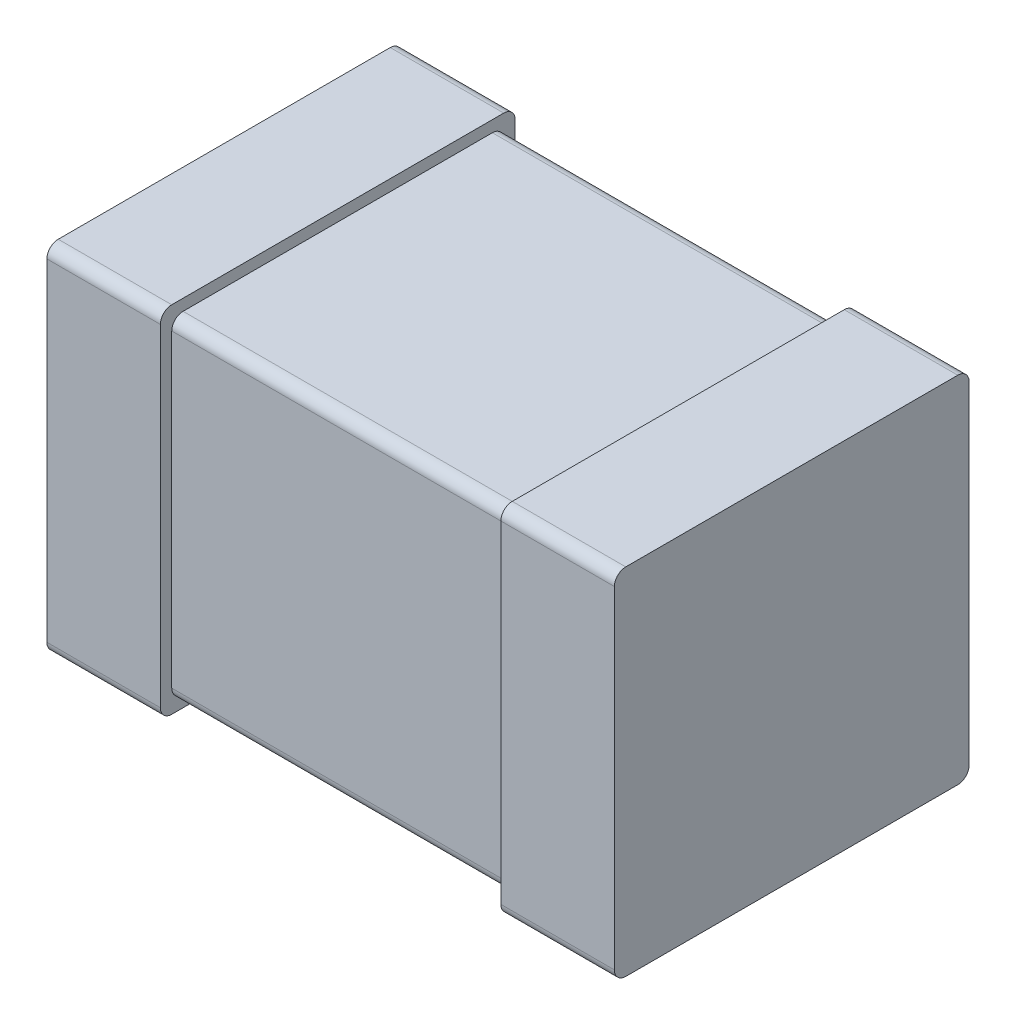
ISO-10303-21;
HEADER;
FILE_DESCRIPTION(('STEP AP214'),'2;1');
FILE_NAME('part.step','',(''),(''),'','','');
FILE_SCHEMA(('AUTOMOTIVE_DESIGN { 1 0 10303 214 1 1 1 1 }'));
ENDSEC;
DATA;
#1=APPLICATION_CONTEXT('core data for automotive mechanical design processes');
#2=APPLICATION_PROTOCOL_DEFINITION('international standard','automotive_design',2000,#1);
#3=PRODUCT_CONTEXT('',#1,'mechanical');
#4=PRODUCT('Part','Part','',(#3));
#5=PRODUCT_RELATED_PRODUCT_CATEGORY('part','',(#4));
#6=PRODUCT_DEFINITION_FORMATION('','',#4);
#7=PRODUCT_DEFINITION_CONTEXT('part definition',#1,'design');
#8=PRODUCT_DEFINITION('design','',#6,#7);
#9=PRODUCT_DEFINITION_SHAPE('','',#8);
#10=(LENGTH_UNIT() NAMED_UNIT(*) SI_UNIT(.MILLI.,.METRE.));
#11=(NAMED_UNIT(*) PLANE_ANGLE_UNIT() SI_UNIT($,.RADIAN.));
#12=(NAMED_UNIT(*) SI_UNIT($,.STERADIAN.) SOLID_ANGLE_UNIT());
#13=UNCERTAINTY_MEASURE_WITH_UNIT(LENGTH_MEASURE(1.E-05),#10,'distance_accuracy_value','');
#14=(GEOMETRIC_REPRESENTATION_CONTEXT(3) GLOBAL_UNCERTAINTY_ASSIGNED_CONTEXT((#13)) GLOBAL_UNIT_ASSIGNED_CONTEXT((#10,
#11,#12)) REPRESENTATION_CONTEXT('',''));
#15=CARTESIAN_POINT('',(0.,0.,0.));
#16=DIRECTION('',(0.,0.,1.));
#17=DIRECTION('',(1.,0.,0.));
#18=AXIS2_PLACEMENT_3D('',#15,#16,#17);
#19=CARTESIAN_POINT('',(-1.,-0.625,0.));
#20=DIRECTION('',(1.,0.,0.));
#21=DIRECTION('',(0.,1.,0.));
#22=AXIS2_PLACEMENT_3D('',#19,#20,#21);
#23=PLANE('',#22);
#24=CARTESIAN_POINT('',(-1.,-0.585,1.21));
#25=DIRECTION('',(-1.,0.,0.));
#26=DIRECTION('',(0.,0.,1.));
#27=AXIS2_PLACEMENT_3D('',#24,#25,#26);
#28=CIRCLE('',#27,0.04);
#29=CARTESIAN_POINT('',(-1.,-0.625,1.21));
#30=VERTEX_POINT('',#29);
#31=CARTESIAN_POINT('',(-1.,-0.585,1.25));
#32=VERTEX_POINT('',#31);
#33=EDGE_CURVE('E11',#30,#32,#28,.T.);
#34=ORIENTED_EDGE('',*,*,#33,.T.);
#35=DIRECTION('',(0.,1.,0.));
#36=VECTOR('',#35,1.);
#37=CARTESIAN_POINT('',(-1.,-0.625,1.25));
#38=LINE('',#37,#36);
#39=CARTESIAN_POINT('',(-1.,0.585,1.25));
#40=VERTEX_POINT('',#39);
#41=EDGE_CURVE('E27',#32,#40,#38,.T.);
#42=ORIENTED_EDGE('',*,*,#41,.T.);
#43=CARTESIAN_POINT('',(-1.,0.585,1.21));
#44=DIRECTION('',(1.,0.,0.));
#45=DIRECTION('',(0.,0.,1.));
#46=AXIS2_PLACEMENT_3D('',#43,#44,#45);
#47=CIRCLE('',#46,0.04);
#48=CARTESIAN_POINT('',(-1.,0.625,1.21));
#49=VERTEX_POINT('',#48);
#50=EDGE_CURVE('E342',#49,#40,#47,.T.);
#51=ORIENTED_EDGE('',*,*,#50,.F.);
#52=DIRECTION('',(0.,0.,1.));
#53=VECTOR('',#52,1.);
#54=CARTESIAN_POINT('',(-1.,0.625,0.));
#55=LINE('',#54,#53);
#56=CARTESIAN_POINT('',(-1.,0.625,0.04));
#57=VERTEX_POINT('',#56);
#58=EDGE_CURVE('E288',#57,#49,#55,.T.);
#59=ORIENTED_EDGE('',*,*,#58,.F.);
#60=CARTESIAN_POINT('',(-1.,0.585,0.04));
#61=DIRECTION('',(-1.,0.,0.));
#62=DIRECTION('',(0.,0.,1.));
#63=AXIS2_PLACEMENT_3D('',#60,#61,#62);
#64=CIRCLE('',#63,0.04);
#65=CARTESIAN_POINT('',(-1.,0.585,0.));
#66=VERTEX_POINT('',#65);
#67=EDGE_CURVE('E501',#57,#66,#64,.T.);
#68=ORIENTED_EDGE('',*,*,#67,.T.);
#69=DIRECTION('',(0.,1.,0.));
#70=VECTOR('',#69,1.);
#71=CARTESIAN_POINT('',(-1.,-0.625,0.));
#72=LINE('',#71,#70);
#73=CARTESIAN_POINT('',(-1.,-0.585,0.));
#74=VERTEX_POINT('',#73);
#75=EDGE_CURVE('E364',#74,#66,#72,.T.);
#76=ORIENTED_EDGE('',*,*,#75,.F.);
#77=CARTESIAN_POINT('',(-1.,-0.585,0.04));
#78=DIRECTION('',(1.,0.,0.));
#79=DIRECTION('',(0.,0.,1.));
#80=AXIS2_PLACEMENT_3D('',#77,#78,#79);
#81=CIRCLE('',#80,0.04);
#82=CARTESIAN_POINT('',(-1.,-0.625,0.04));
#83=VERTEX_POINT('',#82);
#84=EDGE_CURVE('E312',#83,#74,#81,.T.);
#85=ORIENTED_EDGE('',*,*,#84,.F.);
#86=DIRECTION('',(0.,0.,1.));
#87=VECTOR('',#86,1.);
#88=CARTESIAN_POINT('',(-1.,-0.625,0.));
#89=LINE('',#88,#87);
#90=EDGE_CURVE('E410',#83,#30,#89,.T.);
#91=ORIENTED_EDGE('',*,*,#90,.T.);
#92=EDGE_LOOP('',(#34,#42,#51,#59,#68,#76,#85,#91));
#93=FACE_BOUND('',#92,.T.);
#94=ADVANCED_FACE('F16',(#93),#23,.F.);
#95=CARTESIAN_POINT('',(-1.,-0.625,0.));
#96=DIRECTION('',(0.,1.,0.));
#97=DIRECTION('',(1.,0.,0.));
#98=AXIS2_PLACEMENT_3D('',#95,#96,#97);
#99=PLANE('',#98);
#100=DIRECTION('',(1.,0.,0.));
#101=VECTOR('',#100,1.);
#102=CARTESIAN_POINT('',(-1.,-0.625,1.21));
#103=LINE('',#102,#101);
#104=CARTESIAN_POINT('',(-0.6,-0.625,1.21));
#105=VERTEX_POINT('',#104);
#106=EDGE_CURVE('E313',#30,#105,#103,.T.);
#107=ORIENTED_EDGE('',*,*,#106,.F.);
#108=ORIENTED_EDGE('',*,*,#90,.F.);
#109=DIRECTION('',(1.,0.,0.));
#110=VECTOR('',#109,1.);
#111=CARTESIAN_POINT('',(-1.,-0.625,0.04));
#112=LINE('',#111,#110);
#113=CARTESIAN_POINT('',(-0.6,-0.625,0.04));
#114=VERTEX_POINT('',#113);
#115=EDGE_CURVE('E406',#83,#114,#112,.T.);
#116=ORIENTED_EDGE('',*,*,#115,.T.);
#117=DIRECTION('',(0.,0.,1.));
#118=VECTOR('',#117,1.);
#119=CARTESIAN_POINT('',(-0.6,-0.625,0.));
#120=LINE('',#119,#118);
#121=EDGE_CURVE('E411',#114,#105,#120,.T.);
#122=ORIENTED_EDGE('',*,*,#121,.T.);
#123=EDGE_LOOP('',(#107,#108,#116,#122));
#124=FACE_BOUND('',#123,.T.);
#125=ADVANCED_FACE('F566',(#124),#99,.F.);
#126=CARTESIAN_POINT('',(-1.,-0.585,0.04));
#127=DIRECTION('',(1.,0.,0.));
#128=DIRECTION('',(0.,-1.,0.));
#129=AXIS2_PLACEMENT_3D('',#126,#127,#128);
#130=CYLINDRICAL_SURFACE('',#129,0.04);
#131=ORIENTED_EDGE('',*,*,#84,.T.);
#132=DIRECTION('',(1.,0.,0.));
#133=VECTOR('',#132,1.);
#134=CARTESIAN_POINT('',(-1.,-0.585,0.));
#135=LINE('',#134,#133);
#136=CARTESIAN_POINT('',(-0.6,-0.585,0.));
#137=VERTEX_POINT('',#136);
#138=EDGE_CURVE('E308',#74,#137,#135,.T.);
#139=ORIENTED_EDGE('',*,*,#138,.T.);
#140=CARTESIAN_POINT('',(-0.6,-0.585,0.04));
#141=DIRECTION('',(1.,0.,0.));
#142=DIRECTION('',(0.,0.,1.));
#143=AXIS2_PLACEMENT_3D('',#140,#141,#142);
#144=CIRCLE('',#143,0.04);
#145=EDGE_CURVE('E470',#114,#137,#144,.T.);
#146=ORIENTED_EDGE('',*,*,#145,.F.);
#147=ORIENTED_EDGE('',*,*,#115,.F.);
#148=EDGE_LOOP('',(#131,#139,#146,#147));
#149=FACE_BOUND('',#148,.T.);
#150=ADVANCED_FACE('F549',(#149),#130,.T.);
#151=CARTESIAN_POINT('',(-1.,-0.585,1.21));
#152=DIRECTION('',(1.,0.,0.));
#153=DIRECTION('',(0.,-1.,0.));
#154=AXIS2_PLACEMENT_3D('',#151,#152,#153);
#155=CYLINDRICAL_SURFACE('',#154,0.04);
#156=ORIENTED_EDGE('',*,*,#106,.T.);
#157=CARTESIAN_POINT('',(-0.6,-0.585,1.21));
#158=DIRECTION('',(-1.,0.,0.));
#159=DIRECTION('',(0.,0.,1.));
#160=AXIS2_PLACEMENT_3D('',#157,#158,#159);
#161=CIRCLE('',#160,0.04);
#162=CARTESIAN_POINT('',(-0.6,-0.585,1.25));
#163=VERTEX_POINT('',#162);
#164=EDGE_CURVE('E363',#105,#163,#161,.T.);
#165=ORIENTED_EDGE('',*,*,#164,.T.);
#166=DIRECTION('',(1.,0.,0.));
#167=VECTOR('',#166,1.);
#168=CARTESIAN_POINT('',(-1.,-0.585,1.25));
#169=LINE('',#168,#167);
#170=EDGE_CURVE('E387',#32,#163,#169,.T.);
#171=ORIENTED_EDGE('',*,*,#170,.F.);
#172=ORIENTED_EDGE('',*,*,#33,.F.);
#173=EDGE_LOOP('',(#156,#165,#171,#172));
#174=FACE_BOUND('',#173,.T.);
#175=ADVANCED_FACE('F553',(#174),#155,.T.);
#176=CARTESIAN_POINT('',(-1.,-0.625,0.));
#177=DIRECTION('',(0.,0.,1.));
#178=DIRECTION('',(1.,0.,0.));
#179=AXIS2_PLACEMENT_3D('',#176,#177,#178);
#180=PLANE('',#179);
#181=DIRECTION('',(1.,0.,0.));
#182=VECTOR('',#181,1.);
#183=CARTESIAN_POINT('',(-1.,0.585,0.));
#184=LINE('',#183,#182);
#185=CARTESIAN_POINT('',(-0.6,0.585,0.));
#186=VERTEX_POINT('',#185);
#187=EDGE_CURVE('E360',#66,#186,#184,.T.);
#188=ORIENTED_EDGE('',*,*,#187,.T.);
#189=DIRECTION('',(0.,1.,0.));
#190=VECTOR('',#189,1.);
#191=CARTESIAN_POINT('',(-0.6,-0.625,0.));
#192=LINE('',#191,#190);
#193=EDGE_CURVE('E372',#137,#186,#192,.T.);
#194=ORIENTED_EDGE('',*,*,#193,.F.);
#195=ORIENTED_EDGE('',*,*,#138,.F.);
#196=ORIENTED_EDGE('',*,*,#75,.T.);
#197=EDGE_LOOP('',(#188,#194,#195,#196));
#198=FACE_BOUND('',#197,.T.);
#199=ADVANCED_FACE('F551',(#198),#180,.F.);
#200=CARTESIAN_POINT('',(-1.,-0.625,1.25));
#201=DIRECTION('',(0.,0.,1.));
#202=DIRECTION('',(1.,0.,0.));
#203=AXIS2_PLACEMENT_3D('',#200,#201,#202);
#204=PLANE('',#203);
#205=ORIENTED_EDGE('',*,*,#41,.F.);
#206=ORIENTED_EDGE('',*,*,#170,.T.);
#207=DIRECTION('',(0.,1.,0.));
#208=VECTOR('',#207,1.);
#209=CARTESIAN_POINT('',(-0.6,-0.625,1.25));
#210=LINE('',#209,#208);
#211=CARTESIAN_POINT('',(-0.6,0.585,1.25));
#212=VERTEX_POINT('',#211);
#213=EDGE_CURVE('E346',#163,#212,#210,.T.);
#214=ORIENTED_EDGE('',*,*,#213,.T.);
#215=DIRECTION('',(1.,0.,0.));
#216=VECTOR('',#215,1.);
#217=CARTESIAN_POINT('',(-1.,0.585,1.25));
#218=LINE('',#217,#216);
#219=EDGE_CURVE('E424',#40,#212,#218,.T.);
#220=ORIENTED_EDGE('',*,*,#219,.F.);
#221=EDGE_LOOP('',(#205,#206,#214,#220));
#222=FACE_BOUND('',#221,.T.);
#223=ADVANCED_FACE('F526',(#222),#204,.T.);
#224=CARTESIAN_POINT('',(-1.,0.585,0.04));
#225=DIRECTION('',(1.,0.,0.));
#226=DIRECTION('',(0.,1.,0.));
#227=AXIS2_PLACEMENT_3D('',#224,#225,#226);
#228=CYLINDRICAL_SURFACE('',#227,0.04);
#229=DIRECTION('',(1.,0.,0.));
#230=VECTOR('',#229,1.);
#231=CARTESIAN_POINT('',(-1.,0.625,0.04));
#232=LINE('',#231,#230);
#233=CARTESIAN_POINT('',(-0.6,0.625,0.04));
#234=VERTEX_POINT('',#233);
#235=EDGE_CURVE('E341',#57,#234,#232,.T.);
#236=ORIENTED_EDGE('',*,*,#235,.T.);
#237=CARTESIAN_POINT('',(-0.6,0.585,0.04));
#238=DIRECTION('',(-1.,0.,0.));
#239=DIRECTION('',(0.,0.,1.));
#240=AXIS2_PLACEMENT_3D('',#237,#238,#239);
#241=CIRCLE('',#240,0.04);
#242=EDGE_CURVE('E337',#234,#186,#241,.T.);
#243=ORIENTED_EDGE('',*,*,#242,.T.);
#244=ORIENTED_EDGE('',*,*,#187,.F.);
#245=ORIENTED_EDGE('',*,*,#67,.F.);
#246=EDGE_LOOP('',(#236,#243,#244,#245));
#247=FACE_BOUND('',#246,.T.);
#248=ADVANCED_FACE('F539',(#247),#228,.T.);
#249=CARTESIAN_POINT('',(-1.,0.585,1.21));
#250=DIRECTION('',(1.,0.,0.));
#251=DIRECTION('',(0.,1.,0.));
#252=AXIS2_PLACEMENT_3D('',#249,#250,#251);
#253=CYLINDRICAL_SURFACE('',#252,0.04);
#254=ORIENTED_EDGE('',*,*,#50,.T.);
#255=ORIENTED_EDGE('',*,*,#219,.T.);
#256=CARTESIAN_POINT('',(-0.6,0.585,1.21));
#257=DIRECTION('',(1.,0.,0.));
#258=DIRECTION('',(0.,0.,1.));
#259=AXIS2_PLACEMENT_3D('',#256,#257,#258);
#260=CIRCLE('',#259,0.04);
#261=CARTESIAN_POINT('',(-0.6,0.625,1.21));
#262=VERTEX_POINT('',#261);
#263=EDGE_CURVE('E319',#262,#212,#260,.T.);
#264=ORIENTED_EDGE('',*,*,#263,.F.);
#265=DIRECTION('',(1.,0.,0.));
#266=VECTOR('',#265,1.);
#267=CARTESIAN_POINT('',(-1.,0.625,1.21));
#268=LINE('',#267,#266);
#269=EDGE_CURVE('E473',#49,#262,#268,.T.);
#270=ORIENTED_EDGE('',*,*,#269,.F.);
#271=EDGE_LOOP('',(#254,#255,#264,#270));
#272=FACE_BOUND('',#271,.T.);
#273=ADVANCED_FACE('F529',(#272),#253,.T.);
#274=CARTESIAN_POINT('',(-1.,0.625,0.));
#275=DIRECTION('',(0.,1.,0.));
#276=DIRECTION('',(1.,0.,0.));
#277=AXIS2_PLACEMENT_3D('',#274,#275,#276);
#278=PLANE('',#277);
#279=DIRECTION('',(0.,0.,1.));
#280=VECTOR('',#279,1.);
#281=CARTESIAN_POINT('',(-0.6,0.625,0.));
#282=LINE('',#281,#280);
#283=EDGE_CURVE('E323',#234,#262,#282,.T.);
#284=ORIENTED_EDGE('',*,*,#283,.F.);
#285=ORIENTED_EDGE('',*,*,#235,.F.);
#286=ORIENTED_EDGE('',*,*,#58,.T.);
#287=ORIENTED_EDGE('',*,*,#269,.T.);
#288=EDGE_LOOP('',(#284,#285,#286,#287));
#289=FACE_BOUND('',#288,.T.);
#290=ADVANCED_FACE('F532',(#289),#278,.T.);
#291=CARTESIAN_POINT('',(-0.6,-0.625,0.));
#292=DIRECTION('',(1.,0.,0.));
#293=DIRECTION('',(0.,1.,0.));
#294=AXIS2_PLACEMENT_3D('',#291,#292,#293);
#295=PLANE('',#294);
#296=ORIENTED_EDGE('',*,*,#121,.F.);
#297=ORIENTED_EDGE('',*,*,#145,.T.);
#298=ORIENTED_EDGE('',*,*,#193,.T.);
#299=ORIENTED_EDGE('',*,*,#242,.F.);
#300=ORIENTED_EDGE('',*,*,#283,.T.);
#301=ORIENTED_EDGE('',*,*,#263,.T.);
#302=ORIENTED_EDGE('',*,*,#213,.F.);
#303=ORIENTED_EDGE('',*,*,#164,.F.);
#304=EDGE_LOOP('',(#296,#297,#298,#299,#300,#301,#302,#303));
#305=FACE_BOUND('',#304,.T.);
#306=CARTESIAN_POINT('',(-0.6,-0.545,0.08));
#307=DIRECTION('',(1.,0.,0.));
#308=DIRECTION('',(0.,0.,1.));
#309=AXIS2_PLACEMENT_3D('',#306,#307,#308);
#310=CIRCLE('',#309,0.04);
#311=CARTESIAN_POINT('',(-0.6,-0.585,0.08));
#312=VERTEX_POINT('',#311);
#313=CARTESIAN_POINT('',(-0.6,-0.545,0.04));
#314=VERTEX_POINT('',#313);
#315=EDGE_CURVE('E272',#312,#314,#310,.T.);
#316=ORIENTED_EDGE('',*,*,#315,.F.);
#317=DIRECTION('',(0.,0.,1.));
#318=VECTOR('',#317,1.);
#319=CARTESIAN_POINT('',(-0.6,-0.585,0.04));
#320=LINE('',#319,#318);
#321=CARTESIAN_POINT('',(-0.6,-0.585,1.17));
#322=VERTEX_POINT('',#321);
#323=EDGE_CURVE('E324',#312,#322,#320,.T.);
#324=ORIENTED_EDGE('',*,*,#323,.T.);
#325=CARTESIAN_POINT('',(-0.6,-0.545,1.17));
#326=DIRECTION('',(-1.,0.,0.));
#327=DIRECTION('',(0.,0.,1.));
#328=AXIS2_PLACEMENT_3D('',#325,#326,#327);
#329=CIRCLE('',#328,0.04);
#330=CARTESIAN_POINT('',(-0.6,-0.545,1.21));
#331=VERTEX_POINT('',#330);
#332=EDGE_CURVE('E457',#322,#331,#329,.T.);
#333=ORIENTED_EDGE('',*,*,#332,.T.);
#334=DIRECTION('',(0.,1.,0.));
#335=VECTOR('',#334,1.);
#336=CARTESIAN_POINT('',(-0.6,-0.585,1.21));
#337=LINE('',#336,#335);
#338=CARTESIAN_POINT('',(-0.6,0.545,1.21));
#339=VERTEX_POINT('',#338);
#340=EDGE_CURVE('E271',#331,#339,#337,.T.);
#341=ORIENTED_EDGE('',*,*,#340,.T.);
#342=CARTESIAN_POINT('',(-0.6,0.545,1.17));
#343=DIRECTION('',(1.,0.,0.));
#344=DIRECTION('',(0.,0.,1.));
#345=AXIS2_PLACEMENT_3D('',#342,#343,#344);
#346=CIRCLE('',#345,0.04);
#347=CARTESIAN_POINT('',(-0.6,0.585,1.17));
#348=VERTEX_POINT('',#347);
#349=EDGE_CURVE('E253',#348,#339,#346,.T.);
#350=ORIENTED_EDGE('',*,*,#349,.F.);
#351=DIRECTION('',(0.,0.,1.));
#352=VECTOR('',#351,1.);
#353=CARTESIAN_POINT('',(-0.6,0.585,0.04));
#354=LINE('',#353,#352);
#355=CARTESIAN_POINT('',(-0.6,0.585,0.08));
#356=VERTEX_POINT('',#355);
#357=EDGE_CURVE('E247',#356,#348,#354,.T.);
#358=ORIENTED_EDGE('',*,*,#357,.F.);
#359=CARTESIAN_POINT('',(-0.6,0.545,0.08));
#360=DIRECTION('',(-1.,0.,0.));
#361=DIRECTION('',(0.,0.,1.));
#362=AXIS2_PLACEMENT_3D('',#359,#360,#361);
#363=CIRCLE('',#362,0.04);
#364=CARTESIAN_POINT('',(-0.6,0.545,0.04));
#365=VERTEX_POINT('',#364);
#366=EDGE_CURVE('E250',#356,#365,#363,.T.);
#367=ORIENTED_EDGE('',*,*,#366,.T.);
#368=DIRECTION('',(0.,1.,0.));
#369=VECTOR('',#368,1.);
#370=CARTESIAN_POINT('',(-0.6,-0.585,0.04));
#371=LINE('',#370,#369);
#372=EDGE_CURVE('E277',#314,#365,#371,.T.);
#373=ORIENTED_EDGE('',*,*,#372,.F.);
#374=EDGE_LOOP('',(#316,#324,#333,#341,#350,#358,#367,#373));
#375=FACE_BOUND('',#374,.T.);
#376=ADVANCED_FACE('F249',(#305,#375),#295,.T.);
#377=CARTESIAN_POINT('',(-0.6,-0.545,0.08));
#378=DIRECTION('',(1.,0.,0.));
#379=DIRECTION('',(0.,-1.,0.));
#380=AXIS2_PLACEMENT_3D('',#377,#378,#379);
#381=CYLINDRICAL_SURFACE('',#380,0.04);
#382=ORIENTED_EDGE('',*,*,#315,.T.);
#383=DIRECTION('',(1.,0.,0.));
#384=VECTOR('',#383,1.);
#385=CARTESIAN_POINT('',(-0.6,-0.545,0.04));
#386=LINE('',#385,#384);
#387=CARTESIAN_POINT('',(0.6,-0.545,0.04));
#388=VERTEX_POINT('',#387);
#389=EDGE_CURVE('E292',#314,#388,#386,.T.);
#390=ORIENTED_EDGE('',*,*,#389,.T.);
#391=CARTESIAN_POINT('',(0.6,-0.545,0.08));
#392=DIRECTION('',(1.,0.,0.));
#393=DIRECTION('',(0.,0.,1.));
#394=AXIS2_PLACEMENT_3D('',#391,#392,#393);
#395=CIRCLE('',#394,0.04);
#396=CARTESIAN_POINT('',(0.6,-0.585,0.08));
#397=VERTEX_POINT('',#396);
#398=EDGE_CURVE('E469',#397,#388,#395,.T.);
#399=ORIENTED_EDGE('',*,*,#398,.F.);
#400=DIRECTION('',(1.,0.,0.));
#401=VECTOR('',#400,1.);
#402=CARTESIAN_POINT('',(-0.6,-0.585,0.08));
#403=LINE('',#402,#401);
#404=EDGE_CURVE('E427',#312,#397,#403,.T.);
#405=ORIENTED_EDGE('',*,*,#404,.F.);
#406=EDGE_LOOP('',(#382,#390,#399,#405));
#407=FACE_BOUND('',#406,.T.);
#408=ADVANCED_FACE('F581',(#407),#381,.T.);
#409=CARTESIAN_POINT('',(-0.6,-0.585,0.04));
#410=DIRECTION('',(0.,0.,1.));
#411=DIRECTION('',(1.,0.,0.));
#412=AXIS2_PLACEMENT_3D('',#409,#410,#411);
#413=PLANE('',#412);
#414=DIRECTION('',(1.,0.,0.));
#415=VECTOR('',#414,1.);
#416=CARTESIAN_POINT('',(-0.6,0.545,0.04));
#417=LINE('',#416,#415);
#418=CARTESIAN_POINT('',(0.6,0.545,0.04));
#419=VERTEX_POINT('',#418);
#420=EDGE_CURVE('E269',#365,#419,#417,.T.);
#421=ORIENTED_EDGE('',*,*,#420,.T.);
#422=DIRECTION('',(0.,1.,0.));
#423=VECTOR('',#422,1.);
#424=CARTESIAN_POINT('',(0.6,-0.585,0.04));
#425=LINE('',#424,#423);
#426=EDGE_CURVE('E347',#388,#419,#425,.T.);
#427=ORIENTED_EDGE('',*,*,#426,.F.);
#428=ORIENTED_EDGE('',*,*,#389,.F.);
#429=ORIENTED_EDGE('',*,*,#372,.T.);
#430=EDGE_LOOP('',(#421,#427,#428,#429));
#431=FACE_BOUND('',#430,.T.);
#432=ADVANCED_FACE('F578',(#431),#413,.F.);
#433=CARTESIAN_POINT('',(-0.6,0.545,0.08));
#434=DIRECTION('',(1.,0.,0.));
#435=DIRECTION('',(0.,1.,0.));
#436=AXIS2_PLACEMENT_3D('',#433,#434,#435);
#437=CYLINDRICAL_SURFACE('',#436,0.04);
#438=DIRECTION('',(1.,0.,0.));
#439=VECTOR('',#438,1.);
#440=CARTESIAN_POINT('',(-0.6,0.585,0.08));
#441=LINE('',#440,#439);
#442=CARTESIAN_POINT('',(0.6,0.585,0.08));
#443=VERTEX_POINT('',#442);
#444=EDGE_CURVE('E266',#356,#443,#441,.T.);
#445=ORIENTED_EDGE('',*,*,#444,.T.);
#446=CARTESIAN_POINT('',(0.6,0.545,0.08));
#447=DIRECTION('',(-1.,0.,0.));
#448=DIRECTION('',(0.,0.,1.));
#449=AXIS2_PLACEMENT_3D('',#446,#447,#448);
#450=CIRCLE('',#449,0.04);
#451=EDGE_CURVE('E259',#443,#419,#450,.T.);
#452=ORIENTED_EDGE('',*,*,#451,.T.);
#453=ORIENTED_EDGE('',*,*,#420,.F.);
#454=ORIENTED_EDGE('',*,*,#366,.F.);
#455=EDGE_LOOP('',(#445,#452,#453,#454));
#456=FACE_BOUND('',#455,.T.);
#457=ADVANCED_FACE('F264',(#456),#437,.T.);
#458=CARTESIAN_POINT('',(-0.6,0.585,0.04));
#459=DIRECTION('',(0.,1.,0.));
#460=DIRECTION('',(1.,0.,0.));
#461=AXIS2_PLACEMENT_3D('',#458,#459,#460);
#462=PLANE('',#461);
#463=DIRECTION('',(0.,0.,1.));
#464=VECTOR('',#463,1.);
#465=CARTESIAN_POINT('',(0.6,0.585,0.04));
#466=LINE('',#465,#464);
#467=CARTESIAN_POINT('',(0.6,0.585,1.17));
#468=VERTEX_POINT('',#467);
#469=EDGE_CURVE('E275',#443,#468,#466,.T.);
#470=ORIENTED_EDGE('',*,*,#469,.F.);
#471=ORIENTED_EDGE('',*,*,#444,.F.);
#472=ORIENTED_EDGE('',*,*,#357,.T.);
#473=DIRECTION('',(1.,0.,0.));
#474=VECTOR('',#473,1.);
#475=CARTESIAN_POINT('',(-0.6,0.585,1.17));
#476=LINE('',#475,#474);
#477=EDGE_CURVE('E260',#348,#468,#476,.T.);
#478=ORIENTED_EDGE('',*,*,#477,.T.);
#479=EDGE_LOOP('',(#470,#471,#472,#478));
#480=FACE_BOUND('',#479,.T.);
#481=ADVANCED_FACE('F274',(#480),#462,.T.);
#482=CARTESIAN_POINT('',(-0.6,0.545,1.17));
#483=DIRECTION('',(1.,0.,0.));
#484=DIRECTION('',(0.,1.,0.));
#485=AXIS2_PLACEMENT_3D('',#482,#483,#484);
#486=CYLINDRICAL_SURFACE('',#485,0.04);
#487=ORIENTED_EDGE('',*,*,#349,.T.);
#488=DIRECTION('',(1.,0.,0.));
#489=VECTOR('',#488,1.);
#490=CARTESIAN_POINT('',(-0.6,0.545,1.21));
#491=LINE('',#490,#489);
#492=CARTESIAN_POINT('',(0.6,0.545,1.21));
#493=VERTEX_POINT('',#492);
#494=EDGE_CURVE('E325',#339,#493,#491,.T.);
#495=ORIENTED_EDGE('',*,*,#494,.T.);
#496=CARTESIAN_POINT('',(0.6,0.545,1.17));
#497=DIRECTION('',(1.,0.,0.));
#498=DIRECTION('',(0.,0.,1.));
#499=AXIS2_PLACEMENT_3D('',#496,#497,#498);
#500=CIRCLE('',#499,0.04);
#501=EDGE_CURVE('E465',#468,#493,#500,.T.);
#502=ORIENTED_EDGE('',*,*,#501,.F.);
#503=ORIENTED_EDGE('',*,*,#477,.F.);
#504=EDGE_LOOP('',(#487,#495,#502,#503));
#505=FACE_BOUND('',#504,.T.);
#506=ADVANCED_FACE('F629',(#505),#486,.T.);
#507=CARTESIAN_POINT('',(-0.6,-0.585,1.21));
#508=DIRECTION('',(0.,0.,1.));
#509=DIRECTION('',(1.,0.,0.));
#510=AXIS2_PLACEMENT_3D('',#507,#508,#509);
#511=PLANE('',#510);
#512=ORIENTED_EDGE('',*,*,#340,.F.);
#513=DIRECTION('',(1.,0.,0.));
#514=VECTOR('',#513,1.);
#515=CARTESIAN_POINT('',(-0.6,-0.545,1.21));
#516=LINE('',#515,#514);
#517=CARTESIAN_POINT('',(0.6,-0.545,1.21));
#518=VERTEX_POINT('',#517);
#519=EDGE_CURVE('E329',#331,#518,#516,.T.);
#520=ORIENTED_EDGE('',*,*,#519,.T.);
#521=DIRECTION('',(0.,1.,0.));
#522=VECTOR('',#521,1.);
#523=CARTESIAN_POINT('',(0.6,-0.585,1.21));
#524=LINE('',#523,#522);
#525=EDGE_CURVE('E332',#518,#493,#524,.T.);
#526=ORIENTED_EDGE('',*,*,#525,.T.);
#527=ORIENTED_EDGE('',*,*,#494,.F.);
#528=EDGE_LOOP('',(#512,#520,#526,#527));
#529=FACE_BOUND('',#528,.T.);
#530=ADVANCED_FACE('F626',(#529),#511,.T.);
#531=CARTESIAN_POINT('',(-0.6,-0.545,1.17));
#532=DIRECTION('',(1.,0.,0.));
#533=DIRECTION('',(0.,-1.,0.));
#534=AXIS2_PLACEMENT_3D('',#531,#532,#533);
#535=CYLINDRICAL_SURFACE('',#534,0.04);
#536=DIRECTION('',(1.,0.,0.));
#537=VECTOR('',#536,1.);
#538=CARTESIAN_POINT('',(-0.6,-0.585,1.17));
#539=LINE('',#538,#537);
#540=CARTESIAN_POINT('',(0.6,-0.585,1.17));
#541=VERTEX_POINT('',#540);
#542=EDGE_CURVE('E377',#322,#541,#539,.T.);
#543=ORIENTED_EDGE('',*,*,#542,.T.);
#544=CARTESIAN_POINT('',(0.6,-0.545,1.17));
#545=DIRECTION('',(-1.,0.,0.));
#546=DIRECTION('',(0.,0.,1.));
#547=AXIS2_PLACEMENT_3D('',#544,#545,#546);
#548=CIRCLE('',#547,0.04);
#549=EDGE_CURVE('E381',#541,#518,#548,.T.);
#550=ORIENTED_EDGE('',*,*,#549,.T.);
#551=ORIENTED_EDGE('',*,*,#519,.F.);
#552=ORIENTED_EDGE('',*,*,#332,.F.);
#553=EDGE_LOOP('',(#543,#550,#551,#552));
#554=FACE_BOUND('',#553,.T.);
#555=ADVANCED_FACE('F575',(#554),#535,.T.);
#556=CARTESIAN_POINT('',(-0.6,-0.585,0.04));
#557=DIRECTION('',(0.,1.,0.));
#558=DIRECTION('',(1.,0.,0.));
#559=AXIS2_PLACEMENT_3D('',#556,#557,#558);
#560=PLANE('',#559);
#561=ORIENTED_EDGE('',*,*,#542,.F.);
#562=ORIENTED_EDGE('',*,*,#323,.F.);
#563=ORIENTED_EDGE('',*,*,#404,.T.);
#564=DIRECTION('',(0.,0.,1.));
#565=VECTOR('',#564,1.);
#566=CARTESIAN_POINT('',(0.6,-0.585,0.04));
#567=LINE('',#566,#565);
#568=EDGE_CURVE('E317',#397,#541,#567,.T.);
#569=ORIENTED_EDGE('',*,*,#568,.T.);
#570=EDGE_LOOP('',(#561,#562,#563,#569));
#571=FACE_BOUND('',#570,.T.);
#572=ADVANCED_FACE('F620',(#571),#560,.F.);
#573=CARTESIAN_POINT('',(0.6,-0.625,0.));
#574=DIRECTION('',(1.,0.,0.));
#575=DIRECTION('',(0.,1.,0.));
#576=AXIS2_PLACEMENT_3D('',#573,#574,#575);
#577=PLANE('',#576);
#578=CARTESIAN_POINT('',(0.6,-0.585,1.21));
#579=DIRECTION('',(-1.,0.,0.));
#580=DIRECTION('',(0.,0.,1.));
#581=AXIS2_PLACEMENT_3D('',#578,#579,#580);
#582=CIRCLE('',#581,0.04);
#583=CARTESIAN_POINT('',(0.6,-0.625,1.21));
#584=VERTEX_POINT('',#583);
#585=CARTESIAN_POINT('',(0.6,-0.585,1.25));
#586=VERTEX_POINT('',#585);
#587=EDGE_CURVE('E314',#584,#586,#582,.T.);
#588=ORIENTED_EDGE('',*,*,#587,.T.);
#589=DIRECTION('',(0.,1.,0.));
#590=VECTOR('',#589,1.);
#591=CARTESIAN_POINT('',(0.6,-0.625,1.25));
#592=LINE('',#591,#590);
#593=CARTESIAN_POINT('',(0.6,0.585,1.25));
#594=VERTEX_POINT('',#593);
#595=EDGE_CURVE('E318',#586,#594,#592,.T.);
#596=ORIENTED_EDGE('',*,*,#595,.T.);
#597=CARTESIAN_POINT('',(0.6,0.585,1.21));
#598=DIRECTION('',(1.,0.,0.));
#599=DIRECTION('',(0.,0.,1.));
#600=AXIS2_PLACEMENT_3D('',#597,#598,#599);
#601=CIRCLE('',#600,0.04);
#602=CARTESIAN_POINT('',(0.6,0.625,1.21));
#603=VERTEX_POINT('',#602);
#604=EDGE_CURVE('E301',#603,#594,#601,.T.);
#605=ORIENTED_EDGE('',*,*,#604,.F.);
#606=DIRECTION('',(0.,0.,1.));
#607=VECTOR('',#606,1.);
#608=CARTESIAN_POINT('',(0.6,0.625,0.));
#609=LINE('',#608,#607);
#610=CARTESIAN_POINT('',(0.6,0.625,0.04));
#611=VERTEX_POINT('',#610);
#612=EDGE_CURVE('E399',#611,#603,#609,.T.);
#613=ORIENTED_EDGE('',*,*,#612,.F.);
#614=CARTESIAN_POINT('',(0.6,0.585,0.04));
#615=DIRECTION('',(-1.,0.,0.));
#616=DIRECTION('',(0.,0.,1.));
#617=AXIS2_PLACEMENT_3D('',#614,#615,#616);
#618=CIRCLE('',#617,0.04);
#619=CARTESIAN_POINT('',(0.6,0.585,0.));
#620=VERTEX_POINT('',#619);
#621=EDGE_CURVE('E405',#611,#620,#618,.T.);
#622=ORIENTED_EDGE('',*,*,#621,.T.);
#623=DIRECTION('',(0.,1.,0.));
#624=VECTOR('',#623,1.);
#625=CARTESIAN_POINT('',(0.6,-0.625,0.));
#626=LINE('',#625,#624);
#627=CARTESIAN_POINT('',(0.6,-0.585,0.));
#628=VERTEX_POINT('',#627);
#629=EDGE_CURVE('E373',#628,#620,#626,.T.);
#630=ORIENTED_EDGE('',*,*,#629,.F.);
#631=CARTESIAN_POINT('',(0.6,-0.585,0.04));
#632=DIRECTION('',(1.,0.,0.));
#633=DIRECTION('',(0.,0.,1.));
#634=AXIS2_PLACEMENT_3D('',#631,#632,#633);
#635=CIRCLE('',#634,0.04);
#636=CARTESIAN_POINT('',(0.6,-0.625,0.04));
#637=VERTEX_POINT('',#636);
#638=EDGE_CURVE('E305',#637,#628,#635,.T.);
#639=ORIENTED_EDGE('',*,*,#638,.F.);
#640=DIRECTION('',(0.,0.,1.));
#641=VECTOR('',#640,1.);
#642=CARTESIAN_POINT('',(0.6,-0.625,0.));
#643=LINE('',#642,#641);
#644=EDGE_CURVE('E201',#637,#584,#643,.T.);
#645=ORIENTED_EDGE('',*,*,#644,.T.);
#646=EDGE_LOOP('',(#588,#596,#605,#613,#622,#630,#639,#645));
#647=FACE_BOUND('',#646,.T.);
#648=ORIENTED_EDGE('',*,*,#426,.T.);
#649=ORIENTED_EDGE('',*,*,#451,.F.);
#650=ORIENTED_EDGE('',*,*,#469,.T.);
#651=ORIENTED_EDGE('',*,*,#501,.T.);
#652=ORIENTED_EDGE('',*,*,#525,.F.);
#653=ORIENTED_EDGE('',*,*,#549,.F.);
#654=ORIENTED_EDGE('',*,*,#568,.F.);
#655=ORIENTED_EDGE('',*,*,#398,.T.);
#656=EDGE_LOOP('',(#648,#649,#650,#651,#652,#653,#654,#655));
#657=FACE_BOUND('',#656,.T.);
#658=ADVANCED_FACE('F616',(#647,#657),#577,.F.);
#659=CARTESIAN_POINT('',(0.6,-0.625,0.));
#660=DIRECTION('',(0.,1.,0.));
#661=DIRECTION('',(1.,0.,0.));
#662=AXIS2_PLACEMENT_3D('',#659,#660,#661);
#663=PLANE('',#662);
#664=DIRECTION('',(1.,0.,0.));
#665=VECTOR('',#664,1.);
#666=CARTESIAN_POINT('',(0.6,-0.625,1.21));
#667=LINE('',#666,#665);
#668=CARTESIAN_POINT('',(1.,-0.625,1.21));
#669=VERTEX_POINT('',#668);
#670=EDGE_CURVE('E306',#584,#669,#667,.T.);
#671=ORIENTED_EDGE('',*,*,#670,.F.);
#672=ORIENTED_EDGE('',*,*,#644,.F.);
#673=DIRECTION('',(1.,0.,0.));
#674=VECTOR('',#673,1.);
#675=CARTESIAN_POINT('',(0.6,-0.625,0.04));
#676=LINE('',#675,#674);
#677=CARTESIAN_POINT('',(1.,-0.625,0.04));
#678=VERTEX_POINT('',#677);
#679=EDGE_CURVE('E336',#637,#678,#676,.T.);
#680=ORIENTED_EDGE('',*,*,#679,.T.);
#681=DIRECTION('',(0.,0.,1.));
#682=VECTOR('',#681,1.);
#683=CARTESIAN_POINT('',(1.,-0.625,0.));
#684=LINE('',#683,#682);
#685=EDGE_CURVE('E211',#678,#669,#684,.T.);
#686=ORIENTED_EDGE('',*,*,#685,.T.);
#687=EDGE_LOOP('',(#671,#672,#680,#686));
#688=FACE_BOUND('',#687,.T.);
#689=ADVANCED_FACE('F687',(#688),#663,.F.);
#690=CARTESIAN_POINT('',(0.6,-0.585,0.04));
#691=DIRECTION('',(1.,0.,0.));
#692=DIRECTION('',(0.,-1.,0.));
#693=AXIS2_PLACEMENT_3D('',#690,#691,#692);
#694=CYLINDRICAL_SURFACE('',#693,0.04);
#695=ORIENTED_EDGE('',*,*,#638,.T.);
#696=DIRECTION('',(1.,0.,0.));
#697=VECTOR('',#696,1.);
#698=CARTESIAN_POINT('',(0.6,-0.585,0.));
#699=LINE('',#698,#697);
#700=CARTESIAN_POINT('',(1.,-0.585,0.));
#701=VERTEX_POINT('',#700);
#702=EDGE_CURVE('E302',#628,#701,#699,.T.);
#703=ORIENTED_EDGE('',*,*,#702,.T.);
#704=CARTESIAN_POINT('',(1.,-0.585,0.04));
#705=DIRECTION('',(1.,0.,0.));
#706=DIRECTION('',(0.,0.,1.));
#707=AXIS2_PLACEMENT_3D('',#704,#705,#706);
#708=CIRCLE('',#707,0.04);
#709=EDGE_CURVE('E290',#678,#701,#708,.T.);
#710=ORIENTED_EDGE('',*,*,#709,.F.);
#711=ORIENTED_EDGE('',*,*,#679,.F.);
#712=EDGE_LOOP('',(#695,#703,#710,#711));
#713=FACE_BOUND('',#712,.T.);
#714=ADVANCED_FACE('F586',(#713),#694,.T.);
#715=CARTESIAN_POINT('',(0.6,-0.585,1.21));
#716=DIRECTION('',(1.,0.,0.));
#717=DIRECTION('',(0.,-1.,0.));
#718=AXIS2_PLACEMENT_3D('',#715,#716,#717);
#719=CYLINDRICAL_SURFACE('',#718,0.04);
#720=ORIENTED_EDGE('',*,*,#670,.T.);
#721=CARTESIAN_POINT('',(1.,-0.585,1.21));
#722=DIRECTION('',(-1.,0.,0.));
#723=DIRECTION('',(0.,0.,1.));
#724=AXIS2_PLACEMENT_3D('',#721,#722,#723);
#725=CIRCLE('',#724,0.04);
#726=CARTESIAN_POINT('',(1.,-0.585,1.25));
#727=VERTEX_POINT('',#726);
#728=EDGE_CURVE('E391',#669,#727,#725,.T.);
#729=ORIENTED_EDGE('',*,*,#728,.T.);
#730=DIRECTION('',(1.,0.,0.));
#731=VECTOR('',#730,1.);
#732=CARTESIAN_POINT('',(0.6,-0.585,1.25));
#733=LINE('',#732,#731);
#734=EDGE_CURVE('E355',#586,#727,#733,.T.);
#735=ORIENTED_EDGE('',*,*,#734,.F.);
#736=ORIENTED_EDGE('',*,*,#587,.F.);
#737=EDGE_LOOP('',(#720,#729,#735,#736));
#738=FACE_BOUND('',#737,.T.);
#739=ADVANCED_FACE('F583',(#738),#719,.T.);
#740=CARTESIAN_POINT('',(0.6,-0.625,0.));
#741=DIRECTION('',(0.,0.,1.));
#742=DIRECTION('',(1.,0.,0.));
#743=AXIS2_PLACEMENT_3D('',#740,#741,#742);
#744=PLANE('',#743);
#745=DIRECTION('',(1.,0.,0.));
#746=VECTOR('',#745,1.);
#747=CARTESIAN_POINT('',(0.6,0.585,0.));
#748=LINE('',#747,#746);
#749=CARTESIAN_POINT('',(1.,0.585,0.));
#750=VERTEX_POINT('',#749);
#751=EDGE_CURVE('E376',#620,#750,#748,.T.);
#752=ORIENTED_EDGE('',*,*,#751,.T.);
#753=DIRECTION('',(0.,1.,0.));
#754=VECTOR('',#753,1.);
#755=CARTESIAN_POINT('',(1.,-0.625,0.));
#756=LINE('',#755,#754);
#757=EDGE_CURVE('E70',#701,#750,#756,.T.);
#758=ORIENTED_EDGE('',*,*,#757,.F.);
#759=ORIENTED_EDGE('',*,*,#702,.F.);
#760=ORIENTED_EDGE('',*,*,#629,.T.);
#761=EDGE_LOOP('',(#752,#758,#759,#760));
#762=FACE_BOUND('',#761,.T.);
#763=ADVANCED_FACE('F585',(#762),#744,.F.);
#764=CARTESIAN_POINT('',(0.6,-0.625,1.25));
#765=DIRECTION('',(0.,0.,1.));
#766=DIRECTION('',(1.,0.,0.));
#767=AXIS2_PLACEMENT_3D('',#764,#765,#766);
#768=PLANE('',#767);
#769=ORIENTED_EDGE('',*,*,#595,.F.);
#770=ORIENTED_EDGE('',*,*,#734,.T.);
#771=DIRECTION('',(0.,1.,0.));
#772=VECTOR('',#771,1.);
#773=CARTESIAN_POINT('',(1.,-0.625,1.25));
#774=LINE('',#773,#772);
#775=CARTESIAN_POINT('',(1.,0.585,1.25));
#776=VERTEX_POINT('',#775);
#777=EDGE_CURVE('E352',#727,#776,#774,.T.);
#778=ORIENTED_EDGE('',*,*,#777,.T.);
#779=DIRECTION('',(1.,0.,0.));
#780=VECTOR('',#779,1.);
#781=CARTESIAN_POINT('',(0.6,0.585,1.25));
#782=LINE('',#781,#780);
#783=EDGE_CURVE('E85',#594,#776,#782,.T.);
#784=ORIENTED_EDGE('',*,*,#783,.F.);
#785=EDGE_LOOP('',(#769,#770,#778,#784));
#786=FACE_BOUND('',#785,.T.);
#787=ADVANCED_FACE('F18',(#786),#768,.T.);
#788=CARTESIAN_POINT('',(0.6,0.585,0.04));
#789=DIRECTION('',(1.,0.,0.));
#790=DIRECTION('',(0.,1.,0.));
#791=AXIS2_PLACEMENT_3D('',#788,#789,#790);
#792=CYLINDRICAL_SURFACE('',#791,0.04);
#793=DIRECTION('',(1.,0.,0.));
#794=VECTOR('',#793,1.);
#795=CARTESIAN_POINT('',(0.6,0.625,0.04));
#796=LINE('',#795,#794);
#797=CARTESIAN_POINT('',(1.,0.625,0.04));
#798=VERTEX_POINT('',#797);
#799=EDGE_CURVE('E300',#611,#798,#796,.T.);
#800=ORIENTED_EDGE('',*,*,#799,.T.);
#801=CARTESIAN_POINT('',(1.,0.585,0.04));
#802=DIRECTION('',(-1.,0.,0.));
#803=DIRECTION('',(0.,0.,1.));
#804=AXIS2_PLACEMENT_3D('',#801,#802,#803);
#805=CIRCLE('',#804,0.04);
#806=EDGE_CURVE('E296',#798,#750,#805,.T.);
#807=ORIENTED_EDGE('',*,*,#806,.T.);
#808=ORIENTED_EDGE('',*,*,#751,.F.);
#809=ORIENTED_EDGE('',*,*,#621,.F.);
#810=EDGE_LOOP('',(#800,#807,#808,#809));
#811=FACE_BOUND('',#810,.T.);
#812=ADVANCED_FACE('F436',(#811),#792,.T.);
#813=CARTESIAN_POINT('',(0.6,0.585,1.21));
#814=DIRECTION('',(1.,0.,0.));
#815=DIRECTION('',(0.,1.,0.));
#816=AXIS2_PLACEMENT_3D('',#813,#814,#815);
#817=CYLINDRICAL_SURFACE('',#816,0.04);
#818=ORIENTED_EDGE('',*,*,#604,.T.);
#819=ORIENTED_EDGE('',*,*,#783,.T.);
#820=CARTESIAN_POINT('',(1.,0.585,1.21));
#821=DIRECTION('',(1.,0.,0.));
#822=DIRECTION('',(0.,0.,1.));
#823=AXIS2_PLACEMENT_3D('',#820,#821,#822);
#824=CIRCLE('',#823,0.04);
#825=CARTESIAN_POINT('',(1.,0.625,1.21));
#826=VERTEX_POINT('',#825);
#827=EDGE_CURVE('E398',#826,#776,#824,.T.);
#828=ORIENTED_EDGE('',*,*,#827,.F.);
#829=DIRECTION('',(1.,0.,0.));
#830=VECTOR('',#829,1.);
#831=CARTESIAN_POINT('',(0.6,0.625,1.21));
#832=LINE('',#831,#830);
#833=EDGE_CURVE('E20',#603,#826,#832,.T.);
#834=ORIENTED_EDGE('',*,*,#833,.F.);
#835=EDGE_LOOP('',(#818,#819,#828,#834));
#836=FACE_BOUND('',#835,.T.);
#837=ADVANCED_FACE('F445',(#836),#817,.T.);
#838=CARTESIAN_POINT('',(0.6,0.625,0.));
#839=DIRECTION('',(0.,1.,0.));
#840=DIRECTION('',(1.,0.,0.));
#841=AXIS2_PLACEMENT_3D('',#838,#839,#840);
#842=PLANE('',#841);
#843=DIRECTION('',(0.,0.,1.));
#844=VECTOR('',#843,1.);
#845=CARTESIAN_POINT('',(1.,0.625,0.));
#846=LINE('',#845,#844);
#847=EDGE_CURVE('E291',#798,#826,#846,.T.);
#848=ORIENTED_EDGE('',*,*,#847,.F.);
#849=ORIENTED_EDGE('',*,*,#799,.F.);
#850=ORIENTED_EDGE('',*,*,#612,.T.);
#851=ORIENTED_EDGE('',*,*,#833,.T.);
#852=EDGE_LOOP('',(#848,#849,#850,#851));
#853=FACE_BOUND('',#852,.T.);
#854=ADVANCED_FACE('F441',(#853),#842,.T.);
#855=CARTESIAN_POINT('',(1.,-0.625,0.));
#856=DIRECTION('',(1.,0.,0.));
#857=DIRECTION('',(0.,1.,0.));
#858=AXIS2_PLACEMENT_3D('',#855,#856,#857);
#859=PLANE('',#858);
#860=ORIENTED_EDGE('',*,*,#685,.F.);
#861=ORIENTED_EDGE('',*,*,#709,.T.);
#862=ORIENTED_EDGE('',*,*,#757,.T.);
#863=ORIENTED_EDGE('',*,*,#806,.F.);
#864=ORIENTED_EDGE('',*,*,#847,.T.);
#865=ORIENTED_EDGE('',*,*,#827,.T.);
#866=ORIENTED_EDGE('',*,*,#777,.F.);
#867=ORIENTED_EDGE('',*,*,#728,.F.);
#868=EDGE_LOOP('',(#860,#861,#862,#863,#864,#865,#866,#867));
#869=FACE_BOUND('',#868,.T.);
#870=ADVANCED_FACE('F443',(#869),#859,.T.);
#871=CLOSED_SHELL('',(#94,#125,#150,#175,#199,#223,#248,#273,#290,#376,#408,#432,#457,#481,#506,
#530,#555,#572,#658,#689,#714,#739,#763,#787,#812,#837,#854,#870));
#872=MANIFOLD_SOLID_BREP('B1',#871);
#873=ADVANCED_BREP_SHAPE_REPRESENTATION('',(#18,#872),#14);
#874=SHAPE_DEFINITION_REPRESENTATION(#9,#873);
ENDSEC;
END-ISO-10303-21;
